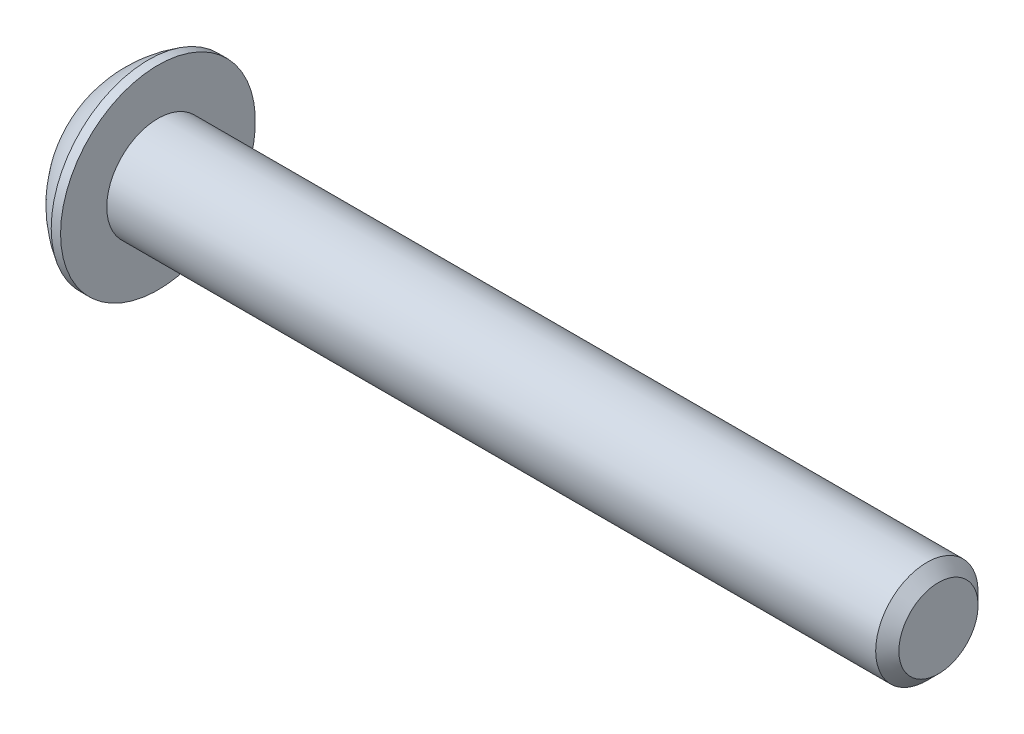
ISO-10303-21;
HEADER;
FILE_DESCRIPTION(('STEP AP214'),'2;1');
FILE_NAME('part.step','',(''),(''),'','','');
FILE_SCHEMA(('AUTOMOTIVE_DESIGN { 1 0 10303 214 1 1 1 1 }'));
ENDSEC;
DATA;
#1=APPLICATION_CONTEXT('core data for automotive mechanical design processes');
#2=APPLICATION_PROTOCOL_DEFINITION('international standard','automotive_design',2000,#1);
#3=PRODUCT_CONTEXT('',#1,'mechanical');
#4=PRODUCT('Part','Part','',(#3));
#5=PRODUCT_RELATED_PRODUCT_CATEGORY('part','',(#4));
#6=PRODUCT_DEFINITION_FORMATION('','',#4);
#7=PRODUCT_DEFINITION_CONTEXT('part definition',#1,'design');
#8=PRODUCT_DEFINITION('design','',#6,#7);
#9=PRODUCT_DEFINITION_SHAPE('','',#8);
#10=(LENGTH_UNIT() NAMED_UNIT(*) SI_UNIT(.MILLI.,.METRE.));
#11=(NAMED_UNIT(*) PLANE_ANGLE_UNIT() SI_UNIT($,.RADIAN.));
#12=(NAMED_UNIT(*) SI_UNIT($,.STERADIAN.) SOLID_ANGLE_UNIT());
#13=UNCERTAINTY_MEASURE_WITH_UNIT(LENGTH_MEASURE(1.E-05),#10,'distance_accuracy_value','');
#14=(GEOMETRIC_REPRESENTATION_CONTEXT(3) GLOBAL_UNCERTAINTY_ASSIGNED_CONTEXT((#13)) GLOBAL_UNIT_ASSIGNED_CONTEXT((#10,
#11,#12)) REPRESENTATION_CONTEXT('',''));
#15=CARTESIAN_POINT('',(0.,0.,0.));
#16=DIRECTION('',(0.,0.,1.));
#17=DIRECTION('',(1.,0.,0.));
#18=AXIS2_PLACEMENT_3D('',#15,#16,#17);
#19=CARTESIAN_POINT('',(1.32079999997359,0.,0.));
#20=DIRECTION('',(-1.,0.,0.));
#21=DIRECTION('',(0.,0.,1.));
#22=AXIS2_PLACEMENT_3D('',#19,#20,#21);
#23=CONICAL_SURFACE('',#22,1.19380000001001,1.04719755119008);
#24=CARTESIAN_POINT('',(2.0100407513155,0.,0.));
#25=VERTEX_POINT('',#24);
#26=VERTEX_LOOP('',#25);
#27=FACE_BOUND('',#26,.T.);
#28=CARTESIAN_POINT('',(1.32079999997359,0.,0.));
#29=DIRECTION('',(-1.,0.,0.));
#30=DIRECTION('',(0.,0.,1.));
#31=AXIS2_PLACEMENT_3D('',#28,#29,#30);
#32=CIRCLE('',#31,1.19380000001001);
#33=CARTESIAN_POINT('',(1.32079999998682,-1.0338611270422,0.596900000002503));
#34=VERTEX_POINT('',#33);
#35=CARTESIAN_POINT('',(1.32079999998682,0.,1.19380000000501));
#36=VERTEX_POINT('',#35);
#37=EDGE_CURVE('E91',#34,#36,#32,.T.);
#38=ORIENTED_EDGE('',*,*,#37,.T.);
#39=CARTESIAN_POINT('',(1.32079999997359,0.,0.));
#40=DIRECTION('',(-1.,0.,0.));
#41=DIRECTION('',(0.,0.,1.));
#42=AXIS2_PLACEMENT_3D('',#39,#40,#41);
#43=CIRCLE('',#42,1.19380000001001);
#44=CARTESIAN_POINT('',(1.32079999998682,1.0338611270422,0.596900000002504));
#45=VERTEX_POINT('',#44);
#46=EDGE_CURVE('E87',#36,#45,#43,.T.);
#47=ORIENTED_EDGE('',*,*,#46,.T.);
#48=CARTESIAN_POINT('',(1.32079999997359,0.,0.));
#49=DIRECTION('',(-1.,0.,0.));
#50=DIRECTION('',(0.,0.,1.));
#51=AXIS2_PLACEMENT_3D('',#48,#49,#50);
#52=CIRCLE('',#51,1.19380000001001);
#53=CARTESIAN_POINT('',(1.32079999998682,1.0338611270422,-0.596900000002504));
#54=VERTEX_POINT('',#53);
#55=EDGE_CURVE('E20',#45,#54,#52,.T.);
#56=ORIENTED_EDGE('',*,*,#55,.T.);
#57=CARTESIAN_POINT('',(1.32079999997359,0.,0.));
#58=DIRECTION('',(-1.,0.,0.));
#59=DIRECTION('',(0.,0.,1.));
#60=AXIS2_PLACEMENT_3D('',#57,#58,#59);
#61=CIRCLE('',#60,1.19380000001001);
#62=CARTESIAN_POINT('',(1.32079999998682,1.49461108489558E-12,-1.19380000000501));
#63=VERTEX_POINT('',#62);
#64=EDGE_CURVE('E150',#54,#63,#61,.T.);
#65=ORIENTED_EDGE('',*,*,#64,.T.);
#66=CARTESIAN_POINT('',(1.32079999997359,0.,0.));
#67=DIRECTION('',(-1.,0.,0.));
#68=DIRECTION('',(0.,0.,1.));
#69=AXIS2_PLACEMENT_3D('',#66,#67,#68);
#70=CIRCLE('',#69,1.19380000001001);
#71=CARTESIAN_POINT('',(1.32079999998682,-1.0338611270422,-0.596900000002503));
#72=VERTEX_POINT('',#71);
#73=EDGE_CURVE('E152',#63,#72,#70,.T.);
#74=ORIENTED_EDGE('',*,*,#73,.T.);
#75=CARTESIAN_POINT('',(1.32079999997359,0.,0.));
#76=DIRECTION('',(-1.,0.,0.));
#77=DIRECTION('',(0.,0.,1.));
#78=AXIS2_PLACEMENT_3D('',#75,#76,#77);
#79=CIRCLE('',#78,1.19380000001001);
#80=EDGE_CURVE('E154',#72,#34,#79,.T.);
#81=ORIENTED_EDGE('',*,*,#80,.T.);
#82=EDGE_LOOP('',(#38,#47,#56,#65,#74,#81));
#83=FACE_BOUND('',#82,.T.);
#84=ADVANCED_FACE('F16',(#27,#83),#23,.F.);
#85=CARTESIAN_POINT('',(1.3208,-2.06772225407572,-1.1938));
#86=DIRECTION('',(1.,0.,0.));
#87=DIRECTION('',(0.,0.,-1.));
#88=AXIS2_PLACEMENT_3D('',#85,#86,#87);
#89=PLANE('',#88);
#90=DIRECTION('',(0.,-0.5,-0.866025403784439));
#91=VECTOR('',#90,1.);
#92=CARTESIAN_POINT('',(1.32080000000004,1.37848150271715,0.));
#93=LINE('',#92,#91);
#94=CARTESIAN_POINT('',(1.32080000000001,1.37848150271715,0.));
#95=VERTEX_POINT('',#94);
#96=EDGE_CURVE('E103',#54,#95,#93,.F.);
#97=ORIENTED_EDGE('',*,*,#96,.F.);
#98=ORIENTED_EDGE('',*,*,#55,.F.);
#99=DIRECTION('',(0.,0.5,-0.866025403784439));
#100=VECTOR('',#99,1.);
#101=CARTESIAN_POINT('',(1.3208,0.689240751358576,1.1938));
#102=LINE('',#101,#100);
#103=EDGE_CURVE('E101',#95,#45,#102,.F.);
#104=ORIENTED_EDGE('',*,*,#103,.F.);
#105=EDGE_LOOP('',(#97,#98,#104));
#106=FACE_BOUND('',#105,.T.);
#107=ADVANCED_FACE('F99',(#106),#89,.F.);
#108=CARTESIAN_POINT('',(1.3208,-2.06772225407572,-1.1938));
#109=DIRECTION('',(1.,0.,0.));
#110=DIRECTION('',(0.,0.,-1.));
#111=AXIS2_PLACEMENT_3D('',#108,#109,#110);
#112=PLANE('',#111);
#113=DIRECTION('',(0.,0.5,-0.866025403784439));
#114=VECTOR('',#113,1.);
#115=CARTESIAN_POINT('',(1.32080000000004,0.689240751358576,1.1938));
#116=LINE('',#115,#114);
#117=CARTESIAN_POINT('',(1.32080000000001,0.689240751358576,1.1938));
#118=VERTEX_POINT('',#117);
#119=EDGE_CURVE('E105',#45,#118,#116,.F.);
#120=ORIENTED_EDGE('',*,*,#119,.F.);
#121=ORIENTED_EDGE('',*,*,#46,.F.);
#122=DIRECTION('',(0.,1.,0.));
#123=VECTOR('',#122,1.);
#124=CARTESIAN_POINT('',(1.3208,-0.689240751358574,1.1938));
#125=LINE('',#124,#123);
#126=EDGE_CURVE('E108',#118,#36,#125,.F.);
#127=ORIENTED_EDGE('',*,*,#126,.F.);
#128=EDGE_LOOP('',(#120,#121,#127));
#129=FACE_BOUND('',#128,.T.);
#130=ADVANCED_FACE('F106',(#129),#112,.F.);
#131=CARTESIAN_POINT('',(1.3208,-2.06772225407572,-1.1938));
#132=DIRECTION('',(1.,0.,0.));
#133=DIRECTION('',(0.,0.,-1.));
#134=AXIS2_PLACEMENT_3D('',#131,#132,#133);
#135=PLANE('',#134);
#136=DIRECTION('',(0.,1.,0.));
#137=VECTOR('',#136,1.);
#138=CARTESIAN_POINT('',(1.32080000000004,-0.689240751358574,1.1938));
#139=LINE('',#138,#137);
#140=CARTESIAN_POINT('',(1.32080000000001,-0.689240751358574,1.1938));
#141=VERTEX_POINT('',#140);
#142=EDGE_CURVE('E168',#36,#141,#139,.F.);
#143=ORIENTED_EDGE('',*,*,#142,.F.);
#144=ORIENTED_EDGE('',*,*,#37,.F.);
#145=DIRECTION('',(0.,0.5,0.866025403784439));
#146=VECTOR('',#145,1.);
#147=CARTESIAN_POINT('',(1.3208,-1.37848150271715,0.));
#148=LINE('',#147,#146);
#149=EDGE_CURVE('E166',#141,#34,#148,.F.);
#150=ORIENTED_EDGE('',*,*,#149,.F.);
#151=EDGE_LOOP('',(#143,#144,#150));
#152=FACE_BOUND('',#151,.T.);
#153=ADVANCED_FACE('F164',(#152),#135,.F.);
#154=CARTESIAN_POINT('',(1.3208,-2.06772225407572,-1.1938));
#155=DIRECTION('',(1.,0.,0.));
#156=DIRECTION('',(0.,0.,-1.));
#157=AXIS2_PLACEMENT_3D('',#154,#155,#156);
#158=PLANE('',#157);
#159=DIRECTION('',(0.,0.5,0.866025403784439));
#160=VECTOR('',#159,1.);
#161=CARTESIAN_POINT('',(1.32080000000004,-1.37848150271715,0.));
#162=LINE('',#161,#160);
#163=CARTESIAN_POINT('',(1.32080000000001,-1.37848150271715,0.));
#164=VERTEX_POINT('',#163);
#165=EDGE_CURVE('E169',#34,#164,#162,.F.);
#166=ORIENTED_EDGE('',*,*,#165,.F.);
#167=ORIENTED_EDGE('',*,*,#80,.F.);
#168=DIRECTION('',(0.,-0.5,0.866025403784439));
#169=VECTOR('',#168,1.);
#170=CARTESIAN_POINT('',(1.3208,-0.689240751358574,-1.1938));
#171=LINE('',#170,#169);
#172=EDGE_CURVE('E172',#164,#72,#171,.F.);
#173=ORIENTED_EDGE('',*,*,#172,.F.);
#174=EDGE_LOOP('',(#166,#167,#173));
#175=FACE_BOUND('',#174,.T.);
#176=ADVANCED_FACE('F170',(#175),#158,.F.);
#177=CARTESIAN_POINT('',(1.3208,-2.06772225407572,-1.1938));
#178=DIRECTION('',(1.,0.,0.));
#179=DIRECTION('',(0.,0.,-1.));
#180=AXIS2_PLACEMENT_3D('',#177,#178,#179);
#181=PLANE('',#180);
#182=DIRECTION('',(0.,-0.5,0.866025403784439));
#183=VECTOR('',#182,1.);
#184=CARTESIAN_POINT('',(1.32080000000004,-0.689240751358574,-1.1938));
#185=LINE('',#184,#183);
#186=CARTESIAN_POINT('',(1.32080000000001,-0.689240751358574,-1.1938));
#187=VERTEX_POINT('',#186);
#188=EDGE_CURVE('E227',#72,#187,#185,.F.);
#189=ORIENTED_EDGE('',*,*,#188,.F.);
#190=ORIENTED_EDGE('',*,*,#73,.F.);
#191=DIRECTION('',(0.,1.,0.));
#192=VECTOR('',#191,1.);
#193=CARTESIAN_POINT('',(1.3208,0.689240751358577,-1.1938));
#194=LINE('',#193,#192);
#195=EDGE_CURVE('E239',#187,#63,#194,.T.);
#196=ORIENTED_EDGE('',*,*,#195,.F.);
#197=EDGE_LOOP('',(#189,#190,#196));
#198=FACE_BOUND('',#197,.T.);
#199=ADVANCED_FACE('F389',(#198),#181,.F.);
#200=CARTESIAN_POINT('',(1.3208,-2.06772225407572,-1.1938));
#201=DIRECTION('',(1.,0.,0.));
#202=DIRECTION('',(0.,0.,-1.));
#203=AXIS2_PLACEMENT_3D('',#200,#201,#202);
#204=PLANE('',#203);
#205=DIRECTION('',(0.,1.,0.));
#206=VECTOR('',#205,1.);
#207=CARTESIAN_POINT('',(1.32080000000004,0.689240751358577,-1.1938));
#208=LINE('',#207,#206);
#209=CARTESIAN_POINT('',(1.32080000000002,0.689240751358565,-1.19380000000002));
#210=VERTEX_POINT('',#209);
#211=EDGE_CURVE('E247',#63,#210,#208,.T.);
#212=ORIENTED_EDGE('',*,*,#211,.F.);
#213=ORIENTED_EDGE('',*,*,#64,.F.);
#214=DIRECTION('',(0.,-0.5,-0.866025403784439));
#215=VECTOR('',#214,1.);
#216=CARTESIAN_POINT('',(1.3208,1.37848150271715,0.));
#217=LINE('',#216,#215);
#218=EDGE_CURVE('E127',#210,#54,#217,.F.);
#219=ORIENTED_EDGE('',*,*,#218,.F.);
#220=EDGE_LOOP('',(#212,#213,#219));
#221=FACE_BOUND('',#220,.T.);
#222=ADVANCED_FACE('F379',(#221),#204,.F.);
#223=CARTESIAN_POINT('',(1.3208,1.37848150271715,0.));
#224=DIRECTION('',(0.,-0.866025403784439,0.5));
#225=DIRECTION('',(0.,-0.5,-0.866025403784439));
#226=AXIS2_PLACEMENT_3D('',#223,#224,#225);
#227=PLANE('',#226);
#228=ORIENTED_EDGE('',*,*,#96,.T.);
#229=DIRECTION('',(1.,0.,0.));
#230=VECTOR('',#229,1.);
#231=CARTESIAN_POINT('',(1.3208,1.37848150271715,0.));
#232=LINE('',#231,#230);
#233=CARTESIAN_POINT('',(0.,1.37848150271715,0.));
#234=VERTEX_POINT('',#233);
#235=EDGE_CURVE('E115',#234,#95,#232,.T.);
#236=ORIENTED_EDGE('',*,*,#235,.F.);
#237=DIRECTION('',(0.,0.5,0.866025403784439));
#238=VECTOR('',#237,1.);
#239=CARTESIAN_POINT('',(0.,0.689240751358577,-1.1938));
#240=LINE('',#239,#238);
#241=CARTESIAN_POINT('',(0.,0.689240751358577,-1.1938));
#242=VERTEX_POINT('',#241);
#243=EDGE_CURVE('E130',#242,#234,#240,.T.);
#244=ORIENTED_EDGE('',*,*,#243,.F.);
#245=DIRECTION('',(1.,0.,0.));
#246=VECTOR('',#245,1.);
#247=CARTESIAN_POINT('',(1.3208,0.689240751358577,-1.1938));
#248=LINE('',#247,#246);
#249=EDGE_CURVE('E134',#210,#242,#248,.F.);
#250=ORIENTED_EDGE('',*,*,#249,.F.);
#251=ORIENTED_EDGE('',*,*,#218,.T.);
#252=EDGE_LOOP('',(#228,#236,#244,#250,#251));
#253=FACE_BOUND('',#252,.T.);
#254=ADVANCED_FACE('F370',(#253),#227,.T.);
#255=CARTESIAN_POINT('',(1.3208,0.689240751358576,1.1938));
#256=DIRECTION('',(0.,-0.866025403784439,-0.5));
#257=DIRECTION('',(0.,0.5,-0.866025403784439));
#258=AXIS2_PLACEMENT_3D('',#255,#256,#257);
#259=PLANE('',#258);
#260=ORIENTED_EDGE('',*,*,#119,.T.);
#261=DIRECTION('',(1.,0.,0.));
#262=VECTOR('',#261,1.);
#263=CARTESIAN_POINT('',(1.3208,0.689240751358576,1.1938));
#264=LINE('',#263,#262);
#265=CARTESIAN_POINT('',(0.,0.689240751358577,1.1938));
#266=VERTEX_POINT('',#265);
#267=EDGE_CURVE('E111',#266,#118,#264,.T.);
#268=ORIENTED_EDGE('',*,*,#267,.F.);
#269=DIRECTION('',(0.,-0.5,0.866025403784439));
#270=VECTOR('',#269,1.);
#271=CARTESIAN_POINT('',(0.,1.37848150271715,0.));
#272=LINE('',#271,#270);
#273=EDGE_CURVE('E133',#234,#266,#272,.T.);
#274=ORIENTED_EDGE('',*,*,#273,.F.);
#275=ORIENTED_EDGE('',*,*,#235,.T.);
#276=ORIENTED_EDGE('',*,*,#103,.T.);
#277=EDGE_LOOP('',(#260,#268,#274,#275,#276));
#278=FACE_BOUND('',#277,.T.);
#279=ADVANCED_FACE('F113',(#278),#259,.T.);
#280=CARTESIAN_POINT('',(1.3208,-0.689240751358574,1.1938));
#281=DIRECTION('',(0.,0.,-1.));
#282=DIRECTION('',(0.,1.,0.));
#283=AXIS2_PLACEMENT_3D('',#280,#281,#282);
#284=PLANE('',#283);
#285=ORIENTED_EDGE('',*,*,#142,.T.);
#286=DIRECTION('',(1.,0.,0.));
#287=VECTOR('',#286,1.);
#288=CARTESIAN_POINT('',(1.3208,-0.689240751358574,1.1938));
#289=LINE('',#288,#287);
#290=CARTESIAN_POINT('',(0.,-0.689240751358574,1.1938));
#291=VERTEX_POINT('',#290);
#292=EDGE_CURVE('E179',#291,#141,#289,.T.);
#293=ORIENTED_EDGE('',*,*,#292,.F.);
#294=DIRECTION('',(0.,1.,0.));
#295=VECTOR('',#294,1.);
#296=CARTESIAN_POINT('',(0.,0.,1.1938));
#297=LINE('',#296,#295);
#298=EDGE_CURVE('E193',#266,#291,#297,.F.);
#299=ORIENTED_EDGE('',*,*,#298,.F.);
#300=ORIENTED_EDGE('',*,*,#267,.T.);
#301=ORIENTED_EDGE('',*,*,#126,.T.);
#302=EDGE_LOOP('',(#285,#293,#299,#300,#301));
#303=FACE_BOUND('',#302,.T.);
#304=ADVANCED_FACE('F215',(#303),#284,.T.);
#305=CARTESIAN_POINT('',(1.3208,-1.37848150271715,0.));
#306=DIRECTION('',(0.,0.866025403784439,-0.5));
#307=DIRECTION('',(0.,0.5,0.866025403784439));
#308=AXIS2_PLACEMENT_3D('',#305,#306,#307);
#309=PLANE('',#308);
#310=ORIENTED_EDGE('',*,*,#165,.T.);
#311=DIRECTION('',(1.,0.,0.));
#312=VECTOR('',#311,1.);
#313=CARTESIAN_POINT('',(1.3208,-1.37848150271715,0.));
#314=LINE('',#313,#312);
#315=CARTESIAN_POINT('',(0.,-1.37848150271715,0.));
#316=VERTEX_POINT('',#315);
#317=EDGE_CURVE('E175',#316,#164,#314,.T.);
#318=ORIENTED_EDGE('',*,*,#317,.F.);
#319=DIRECTION('',(0.,-0.5,-0.866025403784439));
#320=VECTOR('',#319,1.);
#321=CARTESIAN_POINT('',(0.,-0.689240751358574,1.1938));
#322=LINE('',#321,#320);
#323=EDGE_CURVE('E196',#291,#316,#322,.T.);
#324=ORIENTED_EDGE('',*,*,#323,.F.);
#325=ORIENTED_EDGE('',*,*,#292,.T.);
#326=ORIENTED_EDGE('',*,*,#149,.T.);
#327=EDGE_LOOP('',(#310,#318,#324,#325,#326));
#328=FACE_BOUND('',#327,.T.);
#329=ADVANCED_FACE('F177',(#328),#309,.T.);
#330=CARTESIAN_POINT('',(1.3208,-0.689240751358574,-1.1938));
#331=DIRECTION('',(0.,0.866025403784439,0.5));
#332=DIRECTION('',(0.,-0.5,0.866025403784439));
#333=AXIS2_PLACEMENT_3D('',#330,#331,#332);
#334=PLANE('',#333);
#335=ORIENTED_EDGE('',*,*,#188,.T.);
#336=DIRECTION('',(1.,0.,0.));
#337=VECTOR('',#336,1.);
#338=CARTESIAN_POINT('',(1.3208,-0.689240751358574,-1.1938));
#339=LINE('',#338,#337);
#340=CARTESIAN_POINT('',(0.,-0.689240751358574,-1.1938));
#341=VERTEX_POINT('',#340);
#342=EDGE_CURVE('E35',#341,#187,#339,.T.);
#343=ORIENTED_EDGE('',*,*,#342,.F.);
#344=DIRECTION('',(0.,0.5,-0.866025403784439));
#345=VECTOR('',#344,1.);
#346=CARTESIAN_POINT('',(0.,-1.37848150271715,0.));
#347=LINE('',#346,#345);
#348=EDGE_CURVE('E216',#316,#341,#347,.T.);
#349=ORIENTED_EDGE('',*,*,#348,.F.);
#350=ORIENTED_EDGE('',*,*,#317,.T.);
#351=ORIENTED_EDGE('',*,*,#172,.T.);
#352=EDGE_LOOP('',(#335,#343,#349,#350,#351));
#353=FACE_BOUND('',#352,.T.);
#354=ADVANCED_FACE('F336',(#353),#334,.T.);
#355=CARTESIAN_POINT('',(1.3208,0.689240751358577,-1.1938));
#356=DIRECTION('',(0.,0.,1.));
#357=DIRECTION('',(1.,0.,0.));
#358=AXIS2_PLACEMENT_3D('',#355,#356,#357);
#359=PLANE('',#358);
#360=ORIENTED_EDGE('',*,*,#211,.T.);
#361=ORIENTED_EDGE('',*,*,#249,.T.);
#362=DIRECTION('',(0.,1.,0.));
#363=VECTOR('',#362,1.);
#364=CARTESIAN_POINT('',(0.,0.,-1.1938));
#365=LINE('',#364,#363);
#366=EDGE_CURVE('E149',#341,#242,#365,.T.);
#367=ORIENTED_EDGE('',*,*,#366,.F.);
#368=ORIENTED_EDGE('',*,*,#342,.T.);
#369=ORIENTED_EDGE('',*,*,#195,.T.);
#370=EDGE_LOOP('',(#360,#361,#367,#368,#369));
#371=FACE_BOUND('',#370,.T.);
#372=ADVANCED_FACE('F327',(#371),#359,.T.);
#373=CARTESIAN_POINT('',(0.,0.,0.));
#374=DIRECTION('',(-1.,0.,0.));
#375=DIRECTION('',(0.,0.,1.));
#376=AXIS2_PLACEMENT_3D('',#373,#374,#375);
#377=PLANE('',#376);
#378=CARTESIAN_POINT('',(0.,0.,0.));
#379=DIRECTION('',(-1.,0.,0.));
#380=DIRECTION('',(0.,0.,1.));
#381=AXIS2_PLACEMENT_3D('',#378,#379,#380);
#382=CIRCLE('',#381,1.9812);
#383=CARTESIAN_POINT('',(0.,0.,1.9812));
#384=VERTEX_POINT('',#383);
#385=EDGE_CURVE('E146',#384,#384,#382,.F.);
#386=ORIENTED_EDGE('',*,*,#385,.F.);
#387=EDGE_LOOP('',(#386));
#388=FACE_BOUND('',#387,.T.);
#389=ORIENTED_EDGE('',*,*,#348,.T.);
#390=ORIENTED_EDGE('',*,*,#366,.T.);
#391=ORIENTED_EDGE('',*,*,#243,.T.);
#392=ORIENTED_EDGE('',*,*,#273,.T.);
#393=ORIENTED_EDGE('',*,*,#298,.T.);
#394=ORIENTED_EDGE('',*,*,#323,.T.);
#395=EDGE_LOOP('',(#389,#390,#391,#392,#393,#394));
#396=FACE_BOUND('',#395,.T.);
#397=ADVANCED_FACE('F209',(#388,#396),#377,.T.);
#398=CARTESIAN_POINT('',(4.13385,0.,0.));
#399=DIRECTION('',(0.,1.,0.));
#400=DIRECTION('',(-0.489667403954941,0.,-0.871909303485189));
#401=AXIS2_PLACEMENT_3D('',#398,#399,#400);
#402=SPHERICAL_SURFACE('',#401,4.58408870578439);
#403=CARTESIAN_POINT('',(4.13385,0.,0.));
#404=DIRECTION('',(-1.,0.,0.));
#405=DIRECTION('',(0.,0.,1.));
#406=AXIS2_PLACEMENT_3D('',#403,#404,#405);
#407=SPHERICAL_SURFACE('',#406,4.58408870578439);
#408=ORIENTED_EDGE('',*,*,#385,.T.);
#409=EDGE_LOOP('',(#408));
#410=FACE_BOUND('',#409,.T.);
#411=CARTESIAN_POINT('',(1.8288,0.,0.));
#412=DIRECTION('',(-1.,0.,0.));
#413=DIRECTION('',(0.,0.,1.));
#414=AXIS2_PLACEMENT_3D('',#411,#412,#413);
#415=CIRCLE('',#414,3.9624);
#416=CARTESIAN_POINT('',(1.8288,0.,3.9624));
#417=VERTEX_POINT('',#416);
#418=EDGE_CURVE('E143',#417,#417,#415,.F.);
#419=ORIENTED_EDGE('',*,*,#418,.F.);
#420=EDGE_LOOP('',(#419));
#421=FACE_BOUND('',#420,.T.);
#422=ADVANCED_FACE('F18',(#410,#421),#407,.T.);
#423=CARTESIAN_POINT('',(33.9598,0.,0.));
#424=DIRECTION('',(-1.,0.,0.));
#425=DIRECTION('',(0.,0.,1.));
#426=AXIS2_PLACEMENT_3D('',#423,#424,#425);
#427=PLANE('',#426);
#428=CARTESIAN_POINT('',(33.959799999991,0.,0.));
#429=DIRECTION('',(-1.,0.,0.));
#430=DIRECTION('',(0.,0.,1.));
#431=AXIS2_PLACEMENT_3D('',#428,#429,#430);
#432=CIRCLE('',#431,1.61035999997239);
#433=CARTESIAN_POINT('',(33.959799999991,0.,1.61035999997239));
#434=VERTEX_POINT('',#433);
#435=EDGE_CURVE('E140',#434,#434,#432,.T.);
#436=ORIENTED_EDGE('',*,*,#435,.F.);
#437=EDGE_LOOP('',(#436));
#438=FACE_BOUND('',#437,.T.);
#439=ADVANCED_FACE('F269',(#438),#427,.F.);
#440=CARTESIAN_POINT('',(0.,0.,0.));
#441=DIRECTION('',(-1.,0.,0.));
#442=DIRECTION('',(0.,0.,1.));
#443=AXIS2_PLACEMENT_3D('',#440,#441,#442);
#444=CYLINDRICAL_SURFACE('',#443,3.9624);
#445=ORIENTED_EDGE('',*,*,#418,.T.);
#446=EDGE_LOOP('',(#445));
#447=FACE_BOUND('',#446,.T.);
#448=CARTESIAN_POINT('',(2.2098,0.,0.));
#449=DIRECTION('',(-1.,0.,0.));
#450=DIRECTION('',(0.,0.,1.));
#451=AXIS2_PLACEMENT_3D('',#448,#449,#450);
#452=CIRCLE('',#451,3.9624);
#453=CARTESIAN_POINT('',(2.2098,0.,3.9624));
#454=VERTEX_POINT('',#453);
#455=EDGE_CURVE('E137',#454,#454,#452,.T.);
#456=ORIENTED_EDGE('',*,*,#455,.T.);
#457=EDGE_LOOP('',(#456));
#458=FACE_BOUND('',#457,.T.);
#459=ADVANCED_FACE('F265',(#447,#458),#444,.T.);
#460=CARTESIAN_POINT('',(33.4873600000947,0.,0.));
#461=DIRECTION('',(-1.,0.,0.));
#462=DIRECTION('',(0.,0.,1.));
#463=AXIS2_PLACEMENT_3D('',#460,#461,#462);
#464=CONICAL_SURFACE('',#463,2.08279999986871,0.785398163397448);
#465=CARTESIAN_POINT('',(33.48736,0.,0.));
#466=DIRECTION('',(-1.,0.,0.));
#467=DIRECTION('',(0.,0.,1.));
#468=AXIS2_PLACEMENT_3D('',#465,#466,#467);
#469=CIRCLE('',#468,2.0828);
#470=CARTESIAN_POINT('',(33.48736,0.,2.0828));
#471=VERTEX_POINT('',#470);
#472=EDGE_CURVE('E26',#471,#471,#469,.T.);
#473=ORIENTED_EDGE('',*,*,#472,.F.);
#474=EDGE_LOOP('',(#473));
#475=FACE_BOUND('',#474,.T.);
#476=ORIENTED_EDGE('',*,*,#435,.T.);
#477=EDGE_LOOP('',(#476));
#478=FACE_BOUND('',#477,.T.);
#479=ADVANCED_FACE('F261',(#475,#478),#464,.T.);
#480=CARTESIAN_POINT('',(2.2098,2.0828,0.));
#481=DIRECTION('',(-1.,0.,0.));
#482=DIRECTION('',(0.,0.,1.));
#483=AXIS2_PLACEMENT_3D('',#480,#481,#482);
#484=PLANE('',#483);
#485=ORIENTED_EDGE('',*,*,#455,.F.);
#486=EDGE_LOOP('',(#485));
#487=FACE_BOUND('',#486,.T.);
#488=CARTESIAN_POINT('',(2.2098,0.,0.));
#489=DIRECTION('',(-1.,0.,0.));
#490=DIRECTION('',(0.,0.,1.));
#491=AXIS2_PLACEMENT_3D('',#488,#489,#490);
#492=CIRCLE('',#491,2.0828);
#493=CARTESIAN_POINT('',(2.2098,0.,2.0828));
#494=VERTEX_POINT('',#493);
#495=EDGE_CURVE('E11',#494,#494,#492,.F.);
#496=ORIENTED_EDGE('',*,*,#495,.F.);
#497=EDGE_LOOP('',(#496));
#498=FACE_BOUND('',#497,.T.);
#499=ADVANCED_FACE('F264',(#487,#498),#484,.F.);
#500=CARTESIAN_POINT('',(0.,0.,0.));
#501=DIRECTION('',(-1.,0.,0.));
#502=DIRECTION('',(0.,0.,1.));
#503=AXIS2_PLACEMENT_3D('',#500,#501,#502);
#504=CYLINDRICAL_SURFACE('',#503,2.0828);
#505=ORIENTED_EDGE('',*,*,#495,.T.);
#506=EDGE_LOOP('',(#505));
#507=FACE_BOUND('',#506,.T.);
#508=ORIENTED_EDGE('',*,*,#472,.T.);
#509=EDGE_LOOP('',(#508));
#510=FACE_BOUND('',#509,.T.);
#511=ADVANCED_FACE('F259',(#507,#510),#504,.T.);
#512=CLOSED_SHELL('',(#84,#107,#130,#153,#176,#199,#222,#254,#279,#304,#329,#354,#372,#397,#422,
#439,#459,#479,#499,#511));
#513=MANIFOLD_SOLID_BREP('B1',#512);
#514=ADVANCED_BREP_SHAPE_REPRESENTATION('',(#18,#513),#14);
#515=SHAPE_DEFINITION_REPRESENTATION(#9,#514);
ENDSEC;
END-ISO-10303-21;
